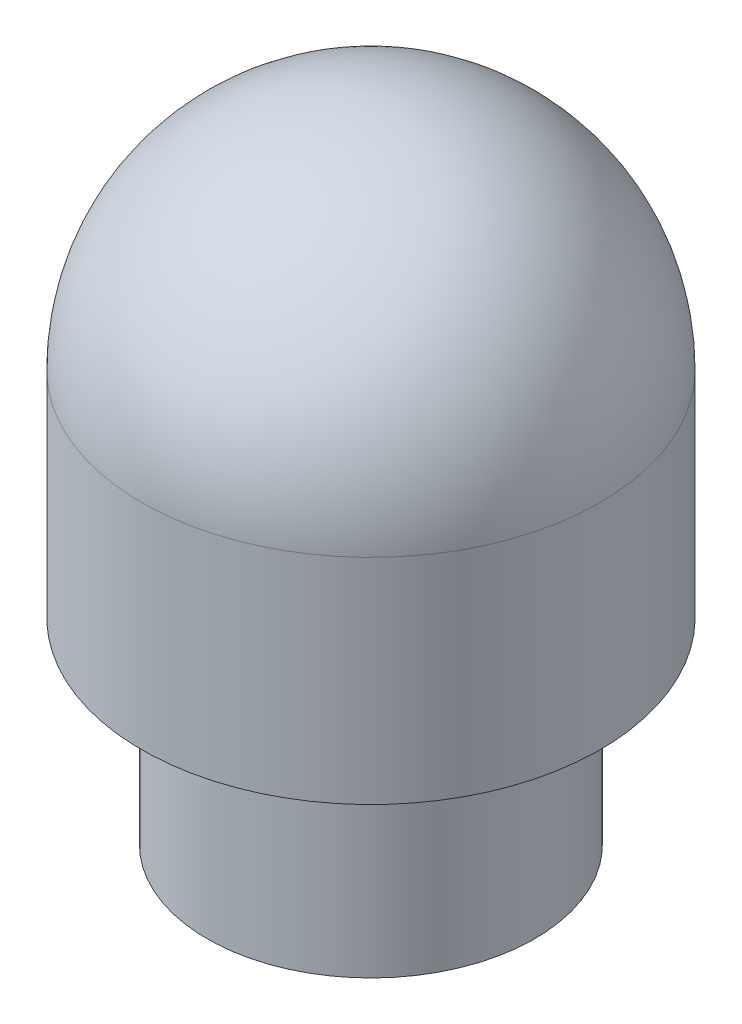
ISO-10303-21;
HEADER;
FILE_DESCRIPTION(('STEP AP214'),'2;1');
FILE_NAME('part.step','',(''),(''),'','','');
FILE_SCHEMA(('AUTOMOTIVE_DESIGN { 1 0 10303 214 1 1 1 1 }'));
ENDSEC;
DATA;
#1=APPLICATION_CONTEXT('core data for automotive mechanical design processes');
#2=APPLICATION_PROTOCOL_DEFINITION('international standard','automotive_design',2000,#1);
#3=PRODUCT_CONTEXT('',#1,'mechanical');
#4=PRODUCT('Part','Part','',(#3));
#5=PRODUCT_RELATED_PRODUCT_CATEGORY('part','',(#4));
#6=PRODUCT_DEFINITION_FORMATION('','',#4);
#7=PRODUCT_DEFINITION_CONTEXT('part definition',#1,'design');
#8=PRODUCT_DEFINITION('design','',#6,#7);
#9=PRODUCT_DEFINITION_SHAPE('','',#8);
#10=(LENGTH_UNIT() NAMED_UNIT(*) SI_UNIT(.MILLI.,.METRE.));
#11=(NAMED_UNIT(*) PLANE_ANGLE_UNIT() SI_UNIT($,.RADIAN.));
#12=(NAMED_UNIT(*) SI_UNIT($,.STERADIAN.) SOLID_ANGLE_UNIT());
#13=UNCERTAINTY_MEASURE_WITH_UNIT(LENGTH_MEASURE(1.E-05),#10,'distance_accuracy_value','');
#14=(GEOMETRIC_REPRESENTATION_CONTEXT(3) GLOBAL_UNCERTAINTY_ASSIGNED_CONTEXT((#13)) GLOBAL_UNIT_ASSIGNED_CONTEXT((#10,
#11,#12)) REPRESENTATION_CONTEXT('',''));
#15=CARTESIAN_POINT('',(0.,0.,0.));
#16=DIRECTION('',(0.,0.,1.));
#17=DIRECTION('',(1.,0.,0.));
#18=AXIS2_PLACEMENT_3D('',#15,#16,#17);
#19=CARTESIAN_POINT('',(0.,0.,-3.96875));
#20=DIRECTION('',(0.,-1.,0.));
#21=DIRECTION('',(0.,0.,-1.));
#22=AXIS2_PLACEMENT_3D('',#19,#20,#21);
#23=PLANE('',#22);
#24=CARTESIAN_POINT('',(0.,0.,0.));
#25=DIRECTION('',(0.,-1.,0.));
#26=DIRECTION('',(0.,0.,-1.));
#27=AXIS2_PLACEMENT_3D('',#24,#25,#26);
#28=CIRCLE('',#27,3.);
#29=CARTESIAN_POINT('',(0.,0.,-3.));
#30=VERTEX_POINT('',#29);
#31=EDGE_CURVE('E53',#30,#30,#28,.T.);
#32=ORIENTED_EDGE('',*,*,#31,.F.);
#33=EDGE_LOOP('',(#32));
#34=FACE_BOUND('',#33,.T.);
#35=CARTESIAN_POINT('',(0.,0.,0.));
#36=DIRECTION('',(0.,-1.,0.));
#37=DIRECTION('',(0.,0.,-1.));
#38=AXIS2_PLACEMENT_3D('',#35,#36,#37);
#39=CIRCLE('',#38,3.96875);
#40=CARTESIAN_POINT('',(0.,0.,-3.96875));
#41=VERTEX_POINT('',#40);
#42=EDGE_CURVE('E50',#41,#41,#39,.T.);
#43=ORIENTED_EDGE('',*,*,#42,.T.);
#44=EDGE_LOOP('',(#43));
#45=FACE_BOUND('',#44,.T.);
#46=ADVANCED_FACE('F30',(#34,#45),#23,.T.);
#47=CARTESIAN_POINT('',(0.,9.95045,0.));
#48=DIRECTION('',(0.,-1.,0.));
#49=DIRECTION('',(0.,0.,-1.));
#50=AXIS2_PLACEMENT_3D('',#47,#48,#49);
#51=SPHERICAL_SURFACE('',#50,5.55625);
#52=CARTESIAN_POINT('',(0.,9.95045,0.));
#53=DIRECTION('',(0.,-1.,0.));
#54=DIRECTION('',(0.,0.,-1.));
#55=AXIS2_PLACEMENT_3D('',#52,#53,#54);
#56=CIRCLE('',#55,5.55625);
#57=CARTESIAN_POINT('',(0.,9.95045,-5.55625));
#58=VERTEX_POINT('',#57);
#59=EDGE_CURVE('E37',#58,#58,#56,.T.);
#60=ORIENTED_EDGE('',*,*,#59,.F.);
#61=EDGE_LOOP('',(#60));
#62=FACE_BOUND('',#61,.T.);
#63=ADVANCED_FACE('F61',(#62),#51,.T.);
#64=CARTESIAN_POINT('',(0.,0.,0.));
#65=DIRECTION('',(0.,-1.,0.));
#66=DIRECTION('',(0.,0.,-1.));
#67=AXIS2_PLACEMENT_3D('',#64,#65,#66);
#68=CYLINDRICAL_SURFACE('',#67,5.55625);
#69=ORIENTED_EDGE('',*,*,#59,.T.);
#70=EDGE_LOOP('',(#69));
#71=FACE_BOUND('',#70,.T.);
#72=CARTESIAN_POINT('',(0.,4.7625,0.));
#73=DIRECTION('',(0.,-1.,0.));
#74=DIRECTION('',(0.,0.,-1.));
#75=AXIS2_PLACEMENT_3D('',#72,#73,#74);
#76=CIRCLE('',#75,5.55625);
#77=CARTESIAN_POINT('',(0.,4.7625,-5.55625));
#78=VERTEX_POINT('',#77);
#79=EDGE_CURVE('E41',#78,#78,#76,.T.);
#80=ORIENTED_EDGE('',*,*,#79,.F.);
#81=EDGE_LOOP('',(#80));
#82=FACE_BOUND('',#81,.T.);
#83=ADVANCED_FACE('F74',(#71,#82),#68,.T.);
#84=CARTESIAN_POINT('',(0.,4.7625,-5.55625));
#85=DIRECTION('',(0.,-1.,0.));
#86=DIRECTION('',(0.,0.,-1.));
#87=AXIS2_PLACEMENT_3D('',#84,#85,#86);
#88=PLANE('',#87);
#89=ORIENTED_EDGE('',*,*,#79,.T.);
#90=EDGE_LOOP('',(#89));
#91=FACE_BOUND('',#90,.T.);
#92=CARTESIAN_POINT('',(0.,4.7625,0.));
#93=DIRECTION('',(0.,-1.,0.));
#94=DIRECTION('',(0.,0.,-1.));
#95=AXIS2_PLACEMENT_3D('',#92,#93,#94);
#96=CIRCLE('',#95,3.96875);
#97=CARTESIAN_POINT('',(0.,4.7625,-3.96875));
#98=VERTEX_POINT('',#97);
#99=EDGE_CURVE('E45',#98,#98,#96,.T.);
#100=ORIENTED_EDGE('',*,*,#99,.F.);
#101=EDGE_LOOP('',(#100));
#102=FACE_BOUND('',#101,.T.);
#103=ADVANCED_FACE('F66',(#91,#102),#88,.T.);
#104=CARTESIAN_POINT('',(0.,0.,0.));
#105=DIRECTION('',(0.,-1.,0.));
#106=DIRECTION('',(0.,0.,-1.));
#107=AXIS2_PLACEMENT_3D('',#104,#105,#106);
#108=CYLINDRICAL_SURFACE('',#107,3.96875);
#109=ORIENTED_EDGE('',*,*,#99,.T.);
#110=EDGE_LOOP('',(#109));
#111=FACE_BOUND('',#110,.T.);
#112=ORIENTED_EDGE('',*,*,#42,.F.);
#113=EDGE_LOOP('',(#112));
#114=FACE_BOUND('',#113,.T.);
#115=ADVANCED_FACE('F64',(#111,#114),#108,.T.);
#116=CARTESIAN_POINT('',(0.,13.97,0.));
#117=DIRECTION('',(0.,-1.,0.));
#118=DIRECTION('',(0.,0.,-1.));
#119=AXIS2_PLACEMENT_3D('',#116,#117,#118);
#120=CYLINDRICAL_SURFACE('',#119,3.);
#121=CARTESIAN_POINT('',(0.,10.97,0.));
#122=DIRECTION('',(0.,-1.,0.));
#123=DIRECTION('',(0.,0.,-1.));
#124=AXIS2_PLACEMENT_3D('',#121,#122,#123);
#125=CIRCLE('',#124,3.);
#126=CARTESIAN_POINT('',(0.,10.97,-3.));
#127=VERTEX_POINT('',#126);
#128=EDGE_CURVE('E10',#127,#127,#125,.F.);
#129=ORIENTED_EDGE('',*,*,#128,.T.);
#130=EDGE_LOOP('',(#129));
#131=FACE_BOUND('',#130,.T.);
#132=ORIENTED_EDGE('',*,*,#31,.T.);
#133=EDGE_LOOP('',(#132));
#134=FACE_BOUND('',#133,.T.);
#135=ADVANCED_FACE('F57',(#131,#134),#120,.F.);
#136=CARTESIAN_POINT('',(0.,10.97,0.));
#137=DIRECTION('',(0.,-1.,0.));
#138=DIRECTION('',(0.,0.,-1.));
#139=AXIS2_PLACEMENT_3D('',#136,#137,#138);
#140=SPHERICAL_SURFACE('',#139,3.);
#141=ORIENTED_EDGE('',*,*,#128,.F.);
#142=EDGE_LOOP('',(#141));
#143=FACE_BOUND('',#142,.T.);
#144=ADVANCED_FACE('F32',(#143),#140,.F.);
#145=CLOSED_SHELL('',(#46,#63,#83,#103,#115,#135,#144));
#146=MANIFOLD_SOLID_BREP('B2',#145);
#147=ADVANCED_BREP_SHAPE_REPRESENTATION('',(#18,#146),#14);
#148=SHAPE_DEFINITION_REPRESENTATION(#9,#147);
ENDSEC;
END-ISO-10303-21;
